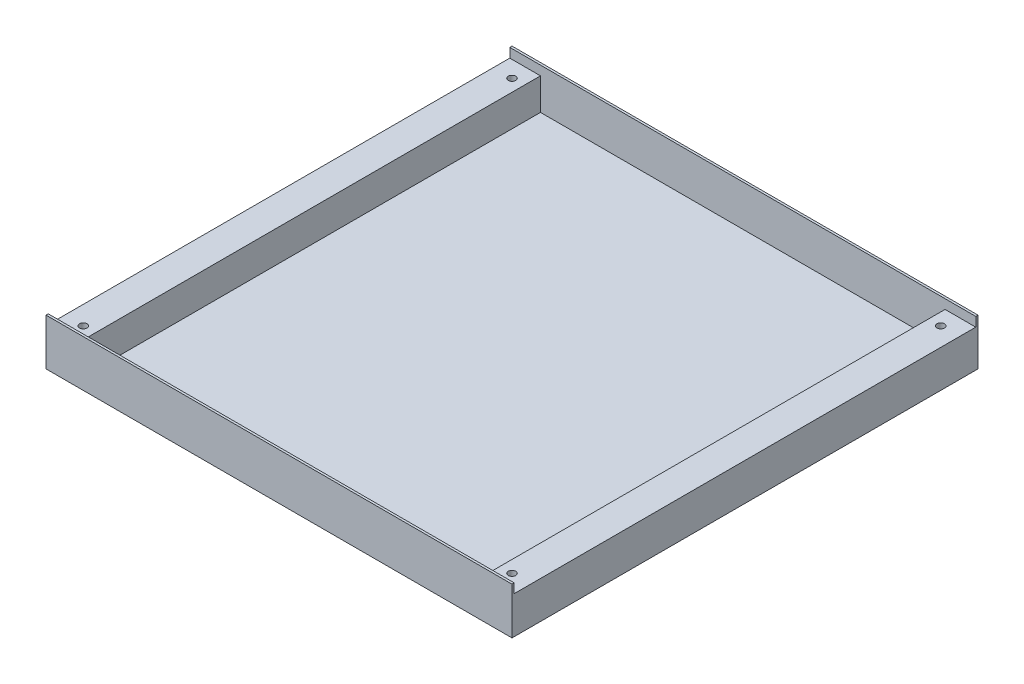
ISO-10303-21;
HEADER;
FILE_DESCRIPTION(('STEP AP214'),'2;1');
FILE_NAME('part.step','',(''),(''),'','','');
FILE_SCHEMA(('AUTOMOTIVE_DESIGN { 1 0 10303 214 1 1 1 1 }'));
ENDSEC;
DATA;
#1=APPLICATION_CONTEXT('core data for automotive mechanical design processes');
#2=APPLICATION_PROTOCOL_DEFINITION('international standard','automotive_design',2000,#1);
#3=PRODUCT_CONTEXT('',#1,'mechanical');
#4=PRODUCT('Part','Part','',(#3));
#5=PRODUCT_RELATED_PRODUCT_CATEGORY('part','',(#4));
#6=PRODUCT_DEFINITION_FORMATION('','',#4);
#7=PRODUCT_DEFINITION_CONTEXT('part definition',#1,'design');
#8=PRODUCT_DEFINITION('design','',#6,#7);
#9=PRODUCT_DEFINITION_SHAPE('','',#8);
#10=(LENGTH_UNIT() NAMED_UNIT(*) SI_UNIT(.MILLI.,.METRE.));
#11=(NAMED_UNIT(*) PLANE_ANGLE_UNIT() SI_UNIT($,.RADIAN.));
#12=(NAMED_UNIT(*) SI_UNIT($,.STERADIAN.) SOLID_ANGLE_UNIT());
#13=UNCERTAINTY_MEASURE_WITH_UNIT(LENGTH_MEASURE(1.E-05),#10,'distance_accuracy_value','');
#14=(GEOMETRIC_REPRESENTATION_CONTEXT(3) GLOBAL_UNCERTAINTY_ASSIGNED_CONTEXT((#13)) GLOBAL_UNIT_ASSIGNED_CONTEXT((#10,
#11,#12)) REPRESENTATION_CONTEXT('',''));
#15=CARTESIAN_POINT('',(0.,0.,0.));
#16=DIRECTION('',(0.,0.,1.));
#17=DIRECTION('',(1.,0.,0.));
#18=AXIS2_PLACEMENT_3D('',#15,#16,#17);
#19=CARTESIAN_POINT('',(0.,3.,0.));
#20=DIRECTION('',(0.,1.,0.));
#21=DIRECTION('',(0.,0.,1.));
#22=AXIS2_PLACEMENT_3D('',#19,#20,#21);
#23=PLANE('',#22);
#24=DIRECTION('',(1.,0.,0.));
#25=VECTOR('',#24,1.);
#26=CARTESIAN_POINT('',(0.,3.,123.8));
#27=LINE('',#26,#25);
#28=CARTESIAN_POINT('',(-108.528058327855,3.,123.8));
#29=VERTEX_POINT('',#28);
#30=CARTESIAN_POINT('',(108.528058327855,3.,123.8));
#31=VERTEX_POINT('',#30);
#32=EDGE_CURVE('E149',#29,#31,#27,.T.);
#33=ORIENTED_EDGE('',*,*,#32,.T.);
#34=DIRECTION('',(0.,0.,1.));
#35=VECTOR('',#34,1.);
#36=CARTESIAN_POINT('',(108.528058327855,3.,0.));
#37=LINE('',#36,#35);
#38=CARTESIAN_POINT('',(108.528058327855,3.,-123.8));
#39=VERTEX_POINT('',#38);
#40=EDGE_CURVE('E49',#39,#31,#37,.T.);
#41=ORIENTED_EDGE('',*,*,#40,.F.);
#42=DIRECTION('',(1.,0.,0.));
#43=VECTOR('',#42,1.);
#44=CARTESIAN_POINT('',(0.,3.,-123.8));
#45=LINE('',#44,#43);
#46=CARTESIAN_POINT('',(-108.528058327855,3.,-123.8));
#47=VERTEX_POINT('',#46);
#48=EDGE_CURVE('E54',#47,#39,#45,.T.);
#49=ORIENTED_EDGE('',*,*,#48,.F.);
#50=DIRECTION('',(0.,0.,1.));
#51=VECTOR('',#50,1.);
#52=CARTESIAN_POINT('',(-108.528058327855,3.,0.));
#53=LINE('',#52,#51);
#54=EDGE_CURVE('E196',#47,#29,#53,.T.);
#55=ORIENTED_EDGE('',*,*,#54,.T.);
#56=EDGE_LOOP('',(#33,#41,#49,#55));
#57=FACE_BOUND('',#56,.T.);
#58=ADVANCED_FACE('F34',(#57),#23,.T.);
#59=CARTESIAN_POINT('',(0.,0.,0.));
#60=DIRECTION('',(0.,1.,0.));
#61=DIRECTION('',(0.,0.,1.));
#62=AXIS2_PLACEMENT_3D('',#59,#60,#61);
#63=PLANE('',#62);
#64=DIRECTION('',(0.,0.,-1.));
#65=VECTOR('',#64,1.);
#66=CARTESIAN_POINT('',(125.,0.,-125.));
#67=LINE('',#66,#65);
#68=CARTESIAN_POINT('',(125.,0.,125.));
#69=VERTEX_POINT('',#68);
#70=CARTESIAN_POINT('',(125.,0.,-125.));
#71=VERTEX_POINT('',#70);
#72=EDGE_CURVE('E231',#69,#71,#67,.T.);
#73=ORIENTED_EDGE('',*,*,#72,.F.);
#74=DIRECTION('',(1.,0.,0.));
#75=VECTOR('',#74,1.);
#76=CARTESIAN_POINT('',(-125.,0.,125.));
#77=LINE('',#76,#75);
#78=CARTESIAN_POINT('',(-125.,0.,125.));
#79=VERTEX_POINT('',#78);
#80=EDGE_CURVE('E238',#79,#69,#77,.T.);
#81=ORIENTED_EDGE('',*,*,#80,.F.);
#82=DIRECTION('',(0.,0.,1.));
#83=VECTOR('',#82,1.);
#84=CARTESIAN_POINT('',(-125.,0.,-125.));
#85=LINE('',#84,#83);
#86=CARTESIAN_POINT('',(-125.,0.,-125.));
#87=VERTEX_POINT('',#86);
#88=EDGE_CURVE('E236',#87,#79,#85,.T.);
#89=ORIENTED_EDGE('',*,*,#88,.F.);
#90=DIRECTION('',(-1.,0.,0.));
#91=VECTOR('',#90,1.);
#92=CARTESIAN_POINT('',(-125.,0.,-125.));
#93=LINE('',#92,#91);
#94=EDGE_CURVE('E234',#71,#87,#93,.T.);
#95=ORIENTED_EDGE('',*,*,#94,.F.);
#96=EDGE_LOOP('',(#73,#81,#89,#95));
#97=FACE_BOUND('',#96,.T.);
#98=CARTESIAN_POINT('',(-115.,0.,-115.));
#99=DIRECTION('',(0.,1.,0.));
#100=DIRECTION('',(0.,0.,1.));
#101=AXIS2_PLACEMENT_3D('',#98,#99,#100);
#102=CIRCLE('',#101,2.);
#103=CARTESIAN_POINT('',(-115.,0.,-113.));
#104=VERTEX_POINT('',#103);
#105=EDGE_CURVE('E228',#104,#104,#102,.T.);
#106=ORIENTED_EDGE('',*,*,#105,.T.);
#107=EDGE_LOOP('',(#106));
#108=FACE_BOUND('',#107,.T.);
#109=CARTESIAN_POINT('',(115.,0.,-115.));
#110=DIRECTION('',(0.,1.,0.));
#111=DIRECTION('',(0.,0.,-1.));
#112=AXIS2_PLACEMENT_3D('',#109,#110,#111);
#113=CIRCLE('',#112,2.);
#114=CARTESIAN_POINT('',(115.,0.,-117.));
#115=VERTEX_POINT('',#114);
#116=EDGE_CURVE('E225',#115,#115,#113,.T.);
#117=ORIENTED_EDGE('',*,*,#116,.T.);
#118=EDGE_LOOP('',(#117));
#119=FACE_BOUND('',#118,.T.);
#120=CARTESIAN_POINT('',(-115.,0.,115.));
#121=DIRECTION('',(0.,1.,0.));
#122=DIRECTION('',(0.,0.,-1.));
#123=AXIS2_PLACEMENT_3D('',#120,#121,#122);
#124=CIRCLE('',#123,2.);
#125=CARTESIAN_POINT('',(-115.,0.,113.));
#126=VERTEX_POINT('',#125);
#127=EDGE_CURVE('E222',#126,#126,#124,.T.);
#128=ORIENTED_EDGE('',*,*,#127,.T.);
#129=EDGE_LOOP('',(#128));
#130=FACE_BOUND('',#129,.T.);
#131=CARTESIAN_POINT('',(115.,0.,115.));
#132=DIRECTION('',(0.,1.,0.));
#133=DIRECTION('',(0.,0.,1.));
#134=AXIS2_PLACEMENT_3D('',#131,#132,#133);
#135=CIRCLE('',#134,2.);
#136=CARTESIAN_POINT('',(115.,0.,117.));
#137=VERTEX_POINT('',#136);
#138=EDGE_CURVE('E219',#137,#137,#135,.T.);
#139=ORIENTED_EDGE('',*,*,#138,.T.);
#140=EDGE_LOOP('',(#139));
#141=FACE_BOUND('',#140,.T.);
#142=ADVANCED_FACE('F252',(#97,#108,#119,#130,#141),#63,.F.);
#143=CARTESIAN_POINT('',(125.,3.,-125.));
#144=DIRECTION('',(-1.,0.,0.));
#145=DIRECTION('',(0.,0.,1.));
#146=AXIS2_PLACEMENT_3D('',#143,#144,#145);
#147=PLANE('',#146);
#148=DIRECTION('',(0.,-1.,0.));
#149=VECTOR('',#148,1.);
#150=CARTESIAN_POINT('',(125.,3.,-125.));
#151=LINE('',#150,#149);
#152=CARTESIAN_POINT('',(125.,25.,-125.));
#153=VERTEX_POINT('',#152);
#154=EDGE_CURVE('E11',#153,#71,#151,.T.);
#155=ORIENTED_EDGE('',*,*,#154,.F.);
#156=DIRECTION('',(0.,0.,-1.));
#157=VECTOR('',#156,1.);
#158=CARTESIAN_POINT('',(125.,25.,0.));
#159=LINE('',#158,#157);
#160=CARTESIAN_POINT('',(125.,25.,-123.8));
#161=VERTEX_POINT('',#160);
#162=EDGE_CURVE('E161',#161,#153,#159,.T.);
#163=ORIENTED_EDGE('',*,*,#162,.F.);
#164=DIRECTION('',(0.,-1.,0.));
#165=VECTOR('',#164,1.);
#166=CARTESIAN_POINT('',(125.,25.,-123.8));
#167=LINE('',#166,#165);
#168=CARTESIAN_POINT('',(125.,20.,-123.8));
#169=VERTEX_POINT('',#168);
#170=EDGE_CURVE('E167',#161,#169,#167,.T.);
#171=ORIENTED_EDGE('',*,*,#170,.T.);
#172=DIRECTION('',(0.,0.,-1.));
#173=VECTOR('',#172,1.);
#174=CARTESIAN_POINT('',(125.,20.,0.));
#175=LINE('',#174,#173);
#176=CARTESIAN_POINT('',(125.,20.,123.8));
#177=VERTEX_POINT('',#176);
#178=EDGE_CURVE('E183',#177,#169,#175,.T.);
#179=ORIENTED_EDGE('',*,*,#178,.F.);
#180=DIRECTION('',(0.,-1.,0.));
#181=VECTOR('',#180,1.);
#182=CARTESIAN_POINT('',(125.,25.,123.8));
#183=LINE('',#182,#181);
#184=CARTESIAN_POINT('',(125.,25.,123.8));
#185=VERTEX_POINT('',#184);
#186=EDGE_CURVE('E133',#185,#177,#183,.T.);
#187=ORIENTED_EDGE('',*,*,#186,.F.);
#188=DIRECTION('',(0.,0.,-1.));
#189=VECTOR('',#188,1.);
#190=CARTESIAN_POINT('',(125.,25.,0.));
#191=LINE('',#190,#189);
#192=CARTESIAN_POINT('',(125.,25.,125.));
#193=VERTEX_POINT('',#192);
#194=EDGE_CURVE('E147',#193,#185,#191,.T.);
#195=ORIENTED_EDGE('',*,*,#194,.F.);
#196=DIRECTION('',(0.,-1.,0.));
#197=VECTOR('',#196,1.);
#198=CARTESIAN_POINT('',(125.,3.,125.));
#199=LINE('',#198,#197);
#200=EDGE_CURVE('E240',#193,#69,#199,.T.);
#201=ORIENTED_EDGE('',*,*,#200,.T.);
#202=ORIENTED_EDGE('',*,*,#72,.T.);
#203=EDGE_LOOP('',(#155,#163,#171,#179,#187,#195,#201,#202));
#204=FACE_BOUND('',#203,.T.);
#205=ADVANCED_FACE('F36',(#204),#147,.F.);
#206=CARTESIAN_POINT('',(-125.,3.,-125.));
#207=DIRECTION('',(0.,0.,1.));
#208=DIRECTION('',(1.,0.,0.));
#209=AXIS2_PLACEMENT_3D('',#206,#207,#208);
#210=PLANE('',#209);
#211=ORIENTED_EDGE('',*,*,#94,.T.);
#212=DIRECTION('',(0.,-1.,0.));
#213=VECTOR('',#212,1.);
#214=CARTESIAN_POINT('',(-125.,3.,-125.));
#215=LINE('',#214,#213);
#216=CARTESIAN_POINT('',(-125.,25.,-125.));
#217=VERTEX_POINT('',#216);
#218=EDGE_CURVE('E42',#217,#87,#215,.T.);
#219=ORIENTED_EDGE('',*,*,#218,.F.);
#220=DIRECTION('',(-1.,0.,0.));
#221=VECTOR('',#220,1.);
#222=CARTESIAN_POINT('',(0.,25.,-125.));
#223=LINE('',#222,#221);
#224=EDGE_CURVE('E164',#153,#217,#223,.T.);
#225=ORIENTED_EDGE('',*,*,#224,.F.);
#226=ORIENTED_EDGE('',*,*,#154,.T.);
#227=EDGE_LOOP('',(#211,#219,#225,#226));
#228=FACE_BOUND('',#227,.T.);
#229=ADVANCED_FACE('F279',(#228),#210,.F.);
#230=CARTESIAN_POINT('',(-125.,3.,-125.));
#231=DIRECTION('',(1.,0.,0.));
#232=DIRECTION('',(0.,0.,-1.));
#233=AXIS2_PLACEMENT_3D('',#230,#231,#232);
#234=PLANE('',#233);
#235=DIRECTION('',(0.,-1.,0.));
#236=VECTOR('',#235,1.);
#237=CARTESIAN_POINT('',(-125.,3.,125.));
#238=LINE('',#237,#236);
#239=CARTESIAN_POINT('',(-125.,25.,125.));
#240=VERTEX_POINT('',#239);
#241=EDGE_CURVE('E139',#240,#79,#238,.T.);
#242=ORIENTED_EDGE('',*,*,#241,.F.);
#243=DIRECTION('',(0.,0.,1.));
#244=VECTOR('',#243,1.);
#245=CARTESIAN_POINT('',(-125.,25.,0.));
#246=LINE('',#245,#244);
#247=CARTESIAN_POINT('',(-125.,25.,123.8));
#248=VERTEX_POINT('',#247);
#249=EDGE_CURVE('E136',#248,#240,#246,.T.);
#250=ORIENTED_EDGE('',*,*,#249,.F.);
#251=DIRECTION('',(0.,-1.,0.));
#252=VECTOR('',#251,1.);
#253=CARTESIAN_POINT('',(-125.,25.,123.8));
#254=LINE('',#253,#252);
#255=CARTESIAN_POINT('',(-125.,20.,123.8));
#256=VERTEX_POINT('',#255);
#257=EDGE_CURVE('E124',#248,#256,#254,.T.);
#258=ORIENTED_EDGE('',*,*,#257,.T.);
#259=DIRECTION('',(0.,0.,1.));
#260=VECTOR('',#259,1.);
#261=CARTESIAN_POINT('',(-125.,20.,0.));
#262=LINE('',#261,#260);
#263=CARTESIAN_POINT('',(-125.,20.,-123.8));
#264=VERTEX_POINT('',#263);
#265=EDGE_CURVE('E200',#264,#256,#262,.T.);
#266=ORIENTED_EDGE('',*,*,#265,.F.);
#267=DIRECTION('',(0.,-1.,0.));
#268=VECTOR('',#267,1.);
#269=CARTESIAN_POINT('',(-125.,25.,-123.8));
#270=LINE('',#269,#268);
#271=CARTESIAN_POINT('',(-125.,25.,-123.8));
#272=VERTEX_POINT('',#271);
#273=EDGE_CURVE('E171',#272,#264,#270,.T.);
#274=ORIENTED_EDGE('',*,*,#273,.F.);
#275=DIRECTION('',(0.,0.,1.));
#276=VECTOR('',#275,1.);
#277=CARTESIAN_POINT('',(-125.,25.,0.));
#278=LINE('',#277,#276);
#279=EDGE_CURVE('E156',#217,#272,#278,.T.);
#280=ORIENTED_EDGE('',*,*,#279,.F.);
#281=ORIENTED_EDGE('',*,*,#218,.T.);
#282=ORIENTED_EDGE('',*,*,#88,.T.);
#283=EDGE_LOOP('',(#242,#250,#258,#266,#274,#280,#281,#282));
#284=FACE_BOUND('',#283,.T.);
#285=ADVANCED_FACE('F137',(#284),#234,.F.);
#286=CARTESIAN_POINT('',(-125.,3.,125.));
#287=DIRECTION('',(0.,0.,-1.));
#288=DIRECTION('',(-1.,0.,0.));
#289=AXIS2_PLACEMENT_3D('',#286,#287,#288);
#290=PLANE('',#289);
#291=ORIENTED_EDGE('',*,*,#80,.T.);
#292=ORIENTED_EDGE('',*,*,#200,.F.);
#293=DIRECTION('',(1.,0.,0.));
#294=VECTOR('',#293,1.);
#295=CARTESIAN_POINT('',(0.,25.,125.));
#296=LINE('',#295,#294);
#297=EDGE_CURVE('E143',#240,#193,#296,.T.);
#298=ORIENTED_EDGE('',*,*,#297,.F.);
#299=ORIENTED_EDGE('',*,*,#241,.T.);
#300=EDGE_LOOP('',(#291,#292,#298,#299));
#301=FACE_BOUND('',#300,.T.);
#302=ADVANCED_FACE('F255',(#301),#290,.F.);
#303=CARTESIAN_POINT('',(-115.,3.,-115.));
#304=DIRECTION('',(0.,-1.,0.));
#305=DIRECTION('',(0.,0.,-1.));
#306=AXIS2_PLACEMENT_3D('',#303,#304,#305);
#307=CYLINDRICAL_SURFACE('',#306,2.);
#308=ORIENTED_EDGE('',*,*,#105,.F.);
#309=EDGE_LOOP('',(#308));
#310=FACE_BOUND('',#309,.T.);
#311=CARTESIAN_POINT('',(-115.,20.,-115.));
#312=DIRECTION('',(0.,1.,0.));
#313=DIRECTION('',(0.,0.,1.));
#314=AXIS2_PLACEMENT_3D('',#311,#312,#313);
#315=CIRCLE('',#314,2.);
#316=CARTESIAN_POINT('',(-115.,20.,-113.));
#317=VERTEX_POINT('',#316);
#318=EDGE_CURVE('E209',#317,#317,#315,.F.);
#319=ORIENTED_EDGE('',*,*,#318,.F.);
#320=EDGE_LOOP('',(#319));
#321=FACE_BOUND('',#320,.T.);
#322=ADVANCED_FACE('F293',(#310,#321),#307,.F.);
#323=CARTESIAN_POINT('',(115.,3.,-115.));
#324=DIRECTION('',(0.,-1.,0.));
#325=DIRECTION('',(0.,0.,-1.));
#326=AXIS2_PLACEMENT_3D('',#323,#324,#325);
#327=CYLINDRICAL_SURFACE('',#326,2.);
#328=ORIENTED_EDGE('',*,*,#116,.F.);
#329=EDGE_LOOP('',(#328));
#330=FACE_BOUND('',#329,.T.);
#331=CARTESIAN_POINT('',(115.,20.,-115.));
#332=DIRECTION('',(0.,1.,0.));
#333=DIRECTION('',(0.,0.,1.));
#334=AXIS2_PLACEMENT_3D('',#331,#332,#333);
#335=CIRCLE('',#334,2.);
#336=CARTESIAN_POINT('',(115.,20.,-113.));
#337=VERTEX_POINT('',#336);
#338=EDGE_CURVE('E185',#337,#337,#335,.F.);
#339=ORIENTED_EDGE('',*,*,#338,.F.);
#340=EDGE_LOOP('',(#339));
#341=FACE_BOUND('',#340,.T.);
#342=ADVANCED_FACE('F300',(#330,#341),#327,.F.);
#343=CARTESIAN_POINT('',(-115.,3.,115.));
#344=DIRECTION('',(0.,-1.,0.));
#345=DIRECTION('',(0.,0.,-1.));
#346=AXIS2_PLACEMENT_3D('',#343,#344,#345);
#347=CYLINDRICAL_SURFACE('',#346,2.);
#348=ORIENTED_EDGE('',*,*,#127,.F.);
#349=EDGE_LOOP('',(#348));
#350=FACE_BOUND('',#349,.T.);
#351=CARTESIAN_POINT('',(-115.,20.,115.));
#352=DIRECTION('',(0.,1.,0.));
#353=DIRECTION('',(0.,0.,1.));
#354=AXIS2_PLACEMENT_3D('',#351,#352,#353);
#355=CIRCLE('',#354,2.);
#356=CARTESIAN_POINT('',(-115.,20.,117.));
#357=VERTEX_POINT('',#356);
#358=EDGE_CURVE('E206',#357,#357,#355,.F.);
#359=ORIENTED_EDGE('',*,*,#358,.F.);
#360=EDGE_LOOP('',(#359));
#361=FACE_BOUND('',#360,.T.);
#362=ADVANCED_FACE('F305',(#350,#361),#347,.F.);
#363=CARTESIAN_POINT('',(115.,3.,115.));
#364=DIRECTION('',(0.,-1.,0.));
#365=DIRECTION('',(0.,0.,-1.));
#366=AXIS2_PLACEMENT_3D('',#363,#364,#365);
#367=CYLINDRICAL_SURFACE('',#366,2.);
#368=ORIENTED_EDGE('',*,*,#138,.F.);
#369=EDGE_LOOP('',(#368));
#370=FACE_BOUND('',#369,.T.);
#371=CARTESIAN_POINT('',(115.,20.,115.));
#372=DIRECTION('',(0.,1.,0.));
#373=DIRECTION('',(0.,0.,1.));
#374=AXIS2_PLACEMENT_3D('',#371,#372,#373);
#375=CIRCLE('',#374,2.);
#376=CARTESIAN_POINT('',(115.,20.,117.));
#377=VERTEX_POINT('',#376);
#378=EDGE_CURVE('E188',#377,#377,#375,.F.);
#379=ORIENTED_EDGE('',*,*,#378,.F.);
#380=EDGE_LOOP('',(#379));
#381=FACE_BOUND('',#380,.T.);
#382=ADVANCED_FACE('F318',(#370,#381),#367,.F.);
#383=CARTESIAN_POINT('',(-108.528058327855,20.,0.));
#384=DIRECTION('',(1.,0.,0.));
#385=DIRECTION('',(0.,0.,-1.));
#386=AXIS2_PLACEMENT_3D('',#383,#384,#385);
#387=PLANE('',#386);
#388=ORIENTED_EDGE('',*,*,#54,.F.);
#389=DIRECTION('',(0.,-1.,0.));
#390=VECTOR('',#389,1.);
#391=CARTESIAN_POINT('',(-108.528058327855,20.,-123.8));
#392=LINE('',#391,#390);
#393=CARTESIAN_POINT('',(-108.528058327855,20.,-123.8));
#394=VERTEX_POINT('',#393);
#395=EDGE_CURVE('E212',#394,#47,#392,.T.);
#396=ORIENTED_EDGE('',*,*,#395,.F.);
#397=DIRECTION('',(0.,0.,1.));
#398=VECTOR('',#397,1.);
#399=CARTESIAN_POINT('',(-108.528058327855,20.,0.));
#400=LINE('',#399,#398);
#401=CARTESIAN_POINT('',(-108.528058327855,20.,123.8));
#402=VERTEX_POINT('',#401);
#403=EDGE_CURVE('E203',#394,#402,#400,.T.);
#404=ORIENTED_EDGE('',*,*,#403,.T.);
#405=DIRECTION('',(0.,-1.,0.));
#406=VECTOR('',#405,1.);
#407=CARTESIAN_POINT('',(-108.528058327855,20.,123.8));
#408=LINE('',#407,#406);
#409=EDGE_CURVE('E216',#402,#29,#408,.T.);
#410=ORIENTED_EDGE('',*,*,#409,.T.);
#411=EDGE_LOOP('',(#388,#396,#404,#410));
#412=FACE_BOUND('',#411,.T.);
#413=ADVANCED_FACE('F267',(#412),#387,.T.);
#414=CARTESIAN_POINT('',(0.,20.,0.));
#415=DIRECTION('',(0.,1.,0.));
#416=DIRECTION('',(0.,0.,1.));
#417=AXIS2_PLACEMENT_3D('',#414,#415,#416);
#418=PLANE('',#417);
#419=DIRECTION('',(1.,0.,0.));
#420=VECTOR('',#419,1.);
#421=CARTESIAN_POINT('',(0.,20.,-123.8));
#422=LINE('',#421,#420);
#423=EDGE_CURVE('E197',#264,#394,#422,.T.);
#424=ORIENTED_EDGE('',*,*,#423,.F.);
#425=ORIENTED_EDGE('',*,*,#265,.T.);
#426=DIRECTION('',(1.,0.,0.));
#427=VECTOR('',#426,1.);
#428=CARTESIAN_POINT('',(0.,20.,123.8));
#429=LINE('',#428,#427);
#430=EDGE_CURVE('E130',#256,#402,#429,.T.);
#431=ORIENTED_EDGE('',*,*,#430,.T.);
#432=ORIENTED_EDGE('',*,*,#403,.F.);
#433=EDGE_LOOP('',(#424,#425,#431,#432));
#434=FACE_BOUND('',#433,.T.);
#435=ORIENTED_EDGE('',*,*,#358,.T.);
#436=EDGE_LOOP('',(#435));
#437=FACE_BOUND('',#436,.T.);
#438=ORIENTED_EDGE('',*,*,#318,.T.);
#439=EDGE_LOOP('',(#438));
#440=FACE_BOUND('',#439,.T.);
#441=ADVANCED_FACE('F271',(#434,#437,#440),#418,.T.);
#442=CARTESIAN_POINT('',(108.528058327855,20.,0.));
#443=DIRECTION('',(1.,0.,0.));
#444=DIRECTION('',(0.,0.,-1.));
#445=AXIS2_PLACEMENT_3D('',#442,#443,#444);
#446=PLANE('',#445);
#447=ORIENTED_EDGE('',*,*,#40,.T.);
#448=DIRECTION('',(0.,-1.,0.));
#449=VECTOR('',#448,1.);
#450=CARTESIAN_POINT('',(108.528058327855,20.,123.8));
#451=LINE('',#450,#449);
#452=CARTESIAN_POINT('',(108.528058327855,20.,123.8));
#453=VERTEX_POINT('',#452);
#454=EDGE_CURVE('E191',#453,#31,#451,.T.);
#455=ORIENTED_EDGE('',*,*,#454,.F.);
#456=DIRECTION('',(0.,0.,1.));
#457=VECTOR('',#456,1.);
#458=CARTESIAN_POINT('',(108.528058327855,20.,0.));
#459=LINE('',#458,#457);
#460=CARTESIAN_POINT('',(108.528058327855,20.,-123.8));
#461=VERTEX_POINT('',#460);
#462=EDGE_CURVE('E177',#461,#453,#459,.T.);
#463=ORIENTED_EDGE('',*,*,#462,.F.);
#464=DIRECTION('',(0.,-1.,0.));
#465=VECTOR('',#464,1.);
#466=CARTESIAN_POINT('',(108.528058327855,20.,-123.8));
#467=LINE('',#466,#465);
#468=EDGE_CURVE('E194',#461,#39,#467,.T.);
#469=ORIENTED_EDGE('',*,*,#468,.T.);
#470=EDGE_LOOP('',(#447,#455,#463,#469));
#471=FACE_BOUND('',#470,.T.);
#472=ADVANCED_FACE('F265',(#471),#446,.F.);
#473=CARTESIAN_POINT('',(0.,20.,0.));
#474=DIRECTION('',(0.,1.,0.));
#475=DIRECTION('',(0.,0.,1.));
#476=AXIS2_PLACEMENT_3D('',#473,#474,#475);
#477=PLANE('',#476);
#478=DIRECTION('',(1.,0.,0.));
#479=VECTOR('',#478,1.);
#480=CARTESIAN_POINT('',(0.,20.,-123.8));
#481=LINE('',#480,#479);
#482=EDGE_CURVE('E174',#461,#169,#481,.T.);
#483=ORIENTED_EDGE('',*,*,#482,.F.);
#484=ORIENTED_EDGE('',*,*,#462,.T.);
#485=DIRECTION('',(1.,0.,0.));
#486=VECTOR('',#485,1.);
#487=CARTESIAN_POINT('',(0.,20.,123.8));
#488=LINE('',#487,#486);
#489=EDGE_CURVE('E180',#453,#177,#488,.T.);
#490=ORIENTED_EDGE('',*,*,#489,.T.);
#491=ORIENTED_EDGE('',*,*,#178,.T.);
#492=EDGE_LOOP('',(#483,#484,#490,#491));
#493=FACE_BOUND('',#492,.T.);
#494=ORIENTED_EDGE('',*,*,#338,.T.);
#495=EDGE_LOOP('',(#494));
#496=FACE_BOUND('',#495,.T.);
#497=ORIENTED_EDGE('',*,*,#378,.T.);
#498=EDGE_LOOP('',(#497));
#499=FACE_BOUND('',#498,.T.);
#500=ADVANCED_FACE('F260',(#493,#496,#499),#477,.T.);
#501=CARTESIAN_POINT('',(0.,25.,-123.8));
#502=DIRECTION('',(0.,0.,-1.));
#503=DIRECTION('',(-1.,0.,0.));
#504=AXIS2_PLACEMENT_3D('',#501,#502,#503);
#505=PLANE('',#504);
#506=ORIENTED_EDGE('',*,*,#395,.T.);
#507=ORIENTED_EDGE('',*,*,#48,.T.);
#508=ORIENTED_EDGE('',*,*,#468,.F.);
#509=ORIENTED_EDGE('',*,*,#482,.T.);
#510=ORIENTED_EDGE('',*,*,#170,.F.);
#511=DIRECTION('',(1.,0.,0.));
#512=VECTOR('',#511,1.);
#513=CARTESIAN_POINT('',(0.,25.,-123.8));
#514=LINE('',#513,#512);
#515=EDGE_CURVE('E159',#272,#161,#514,.T.);
#516=ORIENTED_EDGE('',*,*,#515,.F.);
#517=ORIENTED_EDGE('',*,*,#273,.T.);
#518=ORIENTED_EDGE('',*,*,#423,.T.);
#519=EDGE_LOOP('',(#506,#507,#508,#509,#510,#516,#517,#518));
#520=FACE_BOUND('',#519,.T.);
#521=ADVANCED_FACE('F274',(#520),#505,.F.);
#522=CARTESIAN_POINT('',(0.,25.,0.));
#523=DIRECTION('',(0.,1.,0.));
#524=DIRECTION('',(0.,0.,1.));
#525=AXIS2_PLACEMENT_3D('',#522,#523,#524);
#526=PLANE('',#525);
#527=ORIENTED_EDGE('',*,*,#279,.T.);
#528=ORIENTED_EDGE('',*,*,#515,.T.);
#529=ORIENTED_EDGE('',*,*,#162,.T.);
#530=ORIENTED_EDGE('',*,*,#224,.T.);
#531=EDGE_LOOP('',(#527,#528,#529,#530));
#532=FACE_BOUND('',#531,.T.);
#533=ADVANCED_FACE('F278',(#532),#526,.T.);
#534=CARTESIAN_POINT('',(0.,25.,123.8));
#535=DIRECTION('',(0.,0.,-1.));
#536=DIRECTION('',(-1.,0.,0.));
#537=AXIS2_PLACEMENT_3D('',#534,#535,#536);
#538=PLANE('',#537);
#539=ORIENTED_EDGE('',*,*,#32,.F.);
#540=ORIENTED_EDGE('',*,*,#409,.F.);
#541=ORIENTED_EDGE('',*,*,#430,.F.);
#542=ORIENTED_EDGE('',*,*,#257,.F.);
#543=DIRECTION('',(1.,0.,0.));
#544=VECTOR('',#543,1.);
#545=CARTESIAN_POINT('',(0.,25.,123.8));
#546=LINE('',#545,#544);
#547=EDGE_CURVE('E128',#248,#185,#546,.T.);
#548=ORIENTED_EDGE('',*,*,#547,.T.);
#549=ORIENTED_EDGE('',*,*,#186,.T.);
#550=ORIENTED_EDGE('',*,*,#489,.F.);
#551=ORIENTED_EDGE('',*,*,#454,.T.);
#552=EDGE_LOOP('',(#539,#540,#541,#542,#548,#549,#550,#551));
#553=FACE_BOUND('',#552,.T.);
#554=ADVANCED_FACE('F126',(#553),#538,.T.);
#555=CARTESIAN_POINT('',(0.,25.,0.));
#556=DIRECTION('',(0.,1.,0.));
#557=DIRECTION('',(0.,0.,1.));
#558=AXIS2_PLACEMENT_3D('',#555,#556,#557);
#559=PLANE('',#558);
#560=ORIENTED_EDGE('',*,*,#547,.F.);
#561=ORIENTED_EDGE('',*,*,#249,.T.);
#562=ORIENTED_EDGE('',*,*,#297,.T.);
#563=ORIENTED_EDGE('',*,*,#194,.T.);
#564=EDGE_LOOP('',(#560,#561,#562,#563));
#565=FACE_BOUND('',#564,.T.);
#566=ADVANCED_FACE('F145',(#565),#559,.T.);
#567=CLOSED_SHELL('',(#58,#142,#205,#229,#285,#302,#322,#342,#362,#382,#413,#441,#472,#500,#521,
#533,#554,#566));
#568=MANIFOLD_SOLID_BREP('B2',#567);
#569=ADVANCED_BREP_SHAPE_REPRESENTATION('',(#18,#568),#14);
#570=SHAPE_DEFINITION_REPRESENTATION(#9,#569);
ENDSEC;
END-ISO-10303-21;
